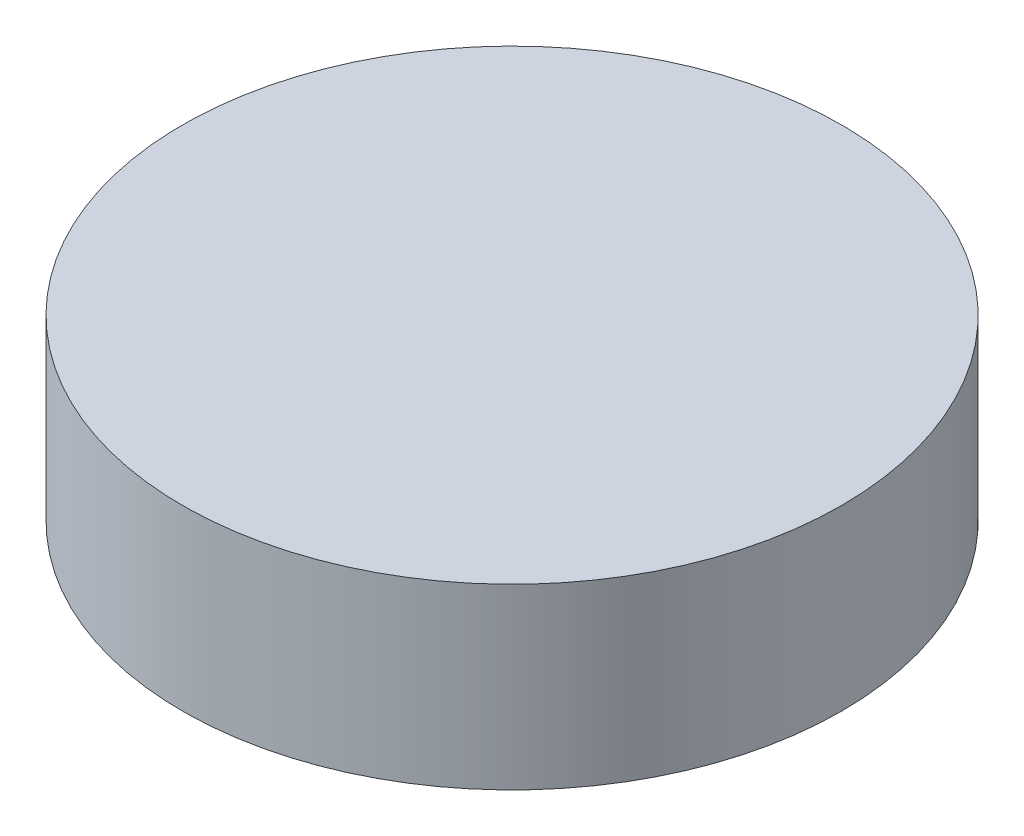
ISO-10303-21;
HEADER;
FILE_DESCRIPTION(('STEP AP214'),'2;1');
FILE_NAME('part.step','',(''),(''),'','','');
FILE_SCHEMA(('AUTOMOTIVE_DESIGN { 1 0 10303 214 1 1 1 1 }'));
ENDSEC;
DATA;
#1=APPLICATION_CONTEXT('core data for automotive mechanical design processes');
#2=APPLICATION_PROTOCOL_DEFINITION('international standard','automotive_design',2000,#1);
#3=PRODUCT_CONTEXT('',#1,'mechanical');
#4=PRODUCT('Part','Part','',(#3));
#5=PRODUCT_RELATED_PRODUCT_CATEGORY('part','',(#4));
#6=PRODUCT_DEFINITION_FORMATION('','',#4);
#7=PRODUCT_DEFINITION_CONTEXT('part definition',#1,'design');
#8=PRODUCT_DEFINITION('design','',#6,#7);
#9=PRODUCT_DEFINITION_SHAPE('','',#8);
#10=(LENGTH_UNIT() NAMED_UNIT(*) SI_UNIT(.MILLI.,.METRE.));
#11=(NAMED_UNIT(*) PLANE_ANGLE_UNIT() SI_UNIT($,.RADIAN.));
#12=(NAMED_UNIT(*) SI_UNIT($,.STERADIAN.) SOLID_ANGLE_UNIT());
#13=UNCERTAINTY_MEASURE_WITH_UNIT(LENGTH_MEASURE(1.E-05),#10,'distance_accuracy_value','');
#14=(GEOMETRIC_REPRESENTATION_CONTEXT(3) GLOBAL_UNCERTAINTY_ASSIGNED_CONTEXT((#13)) GLOBAL_UNIT_ASSIGNED_CONTEXT((#10,
#11,#12)) REPRESENTATION_CONTEXT('',''));
#15=CARTESIAN_POINT('',(0.,0.,0.));
#16=DIRECTION('',(0.,0.,1.));
#17=DIRECTION('',(1.,0.,0.));
#18=AXIS2_PLACEMENT_3D('',#15,#16,#17);
#19=CARTESIAN_POINT('',(0.,16.,0.));
#20=DIRECTION('',(0.,-1.,0.));
#21=DIRECTION('',(1.,0.,0.));
#22=AXIS2_PLACEMENT_3D('',#19,#20,#21);
#23=PLANE('',#22);
#24=CARTESIAN_POINT('',(0.,16.,0.));
#25=DIRECTION('',(0.,-1.,0.));
#26=DIRECTION('',(1.,0.,0.));
#27=AXIS2_PLACEMENT_3D('',#24,#25,#26);
#28=CIRCLE('',#27,22.5);
#29=CARTESIAN_POINT('',(22.5,16.,0.));
#30=VERTEX_POINT('',#29);
#31=EDGE_CURVE('E10',#30,#30,#28,.T.);
#32=ORIENTED_EDGE('',*,*,#31,.T.);
#33=EDGE_LOOP('',(#32));
#34=FACE_BOUND('',#33,.T.);
#35=ADVANCED_FACE('F31',(#34),#23,.T.);
#36=CARTESIAN_POINT('',(0.,0.,0.));
#37=DIRECTION('',(0.,-1.,0.));
#38=DIRECTION('',(1.,0.,0.));
#39=AXIS2_PLACEMENT_3D('',#36,#37,#38);
#40=CYLINDRICAL_SURFACE('',#39,22.5);
#41=CARTESIAN_POINT('',(0.,13.,0.));
#42=DIRECTION('',(0.,-1.,0.));
#43=DIRECTION('',(1.,0.,0.));
#44=AXIS2_PLACEMENT_3D('',#41,#42,#43);
#45=CIRCLE('',#44,22.5);
#46=CARTESIAN_POINT('',(22.5,13.,0.));
#47=VERTEX_POINT('',#46);
#48=EDGE_CURVE('E37',#47,#47,#45,.T.);
#49=ORIENTED_EDGE('',*,*,#48,.T.);
#50=EDGE_LOOP('',(#49));
#51=FACE_BOUND('',#50,.T.);
#52=ORIENTED_EDGE('',*,*,#31,.F.);
#53=EDGE_LOOP('',(#52));
#54=FACE_BOUND('',#53,.T.);
#55=ADVANCED_FACE('F63',(#51,#54),#40,.F.);
#56=CARTESIAN_POINT('',(22.5,13.,0.));
#57=DIRECTION('',(0.,-1.,0.));
#58=DIRECTION('',(1.,0.,0.));
#59=AXIS2_PLACEMENT_3D('',#56,#57,#58);
#60=PLANE('',#59);
#61=CARTESIAN_POINT('',(0.,13.,0.));
#62=DIRECTION('',(0.,-1.,0.));
#63=DIRECTION('',(1.,0.,0.));
#64=AXIS2_PLACEMENT_3D('',#61,#62,#63);
#65=CIRCLE('',#64,37.);
#66=CARTESIAN_POINT('',(37.,13.,0.));
#67=VERTEX_POINT('',#66);
#68=EDGE_CURVE('E41',#67,#67,#65,.T.);
#69=ORIENTED_EDGE('',*,*,#68,.T.);
#70=EDGE_LOOP('',(#69));
#71=FACE_BOUND('',#70,.T.);
#72=ORIENTED_EDGE('',*,*,#48,.F.);
#73=EDGE_LOOP('',(#72));
#74=FACE_BOUND('',#73,.T.);
#75=ADVANCED_FACE('F60',(#71,#74),#60,.T.);
#76=CARTESIAN_POINT('',(0.,0.,0.));
#77=DIRECTION('',(0.,-1.,0.));
#78=DIRECTION('',(1.,0.,0.));
#79=AXIS2_PLACEMENT_3D('',#76,#77,#78);
#80=CYLINDRICAL_SURFACE('',#79,37.);
#81=CARTESIAN_POINT('',(0.,33.,0.));
#82=DIRECTION('',(0.,-1.,0.));
#83=DIRECTION('',(1.,0.,0.));
#84=AXIS2_PLACEMENT_3D('',#81,#82,#83);
#85=CIRCLE('',#84,37.);
#86=CARTESIAN_POINT('',(37.,33.,0.));
#87=VERTEX_POINT('',#86);
#88=EDGE_CURVE('E45',#87,#87,#85,.T.);
#89=ORIENTED_EDGE('',*,*,#88,.T.);
#90=EDGE_LOOP('',(#89));
#91=FACE_BOUND('',#90,.T.);
#92=ORIENTED_EDGE('',*,*,#68,.F.);
#93=EDGE_LOOP('',(#92));
#94=FACE_BOUND('',#93,.T.);
#95=ADVANCED_FACE('F51',(#91,#94),#80,.T.);
#96=CARTESIAN_POINT('',(37.,33.,0.));
#97=DIRECTION('',(0.,1.,0.));
#98=DIRECTION('',(-1.,0.,0.));
#99=AXIS2_PLACEMENT_3D('',#96,#97,#98);
#100=PLANE('',#99);
#101=ORIENTED_EDGE('',*,*,#88,.F.);
#102=EDGE_LOOP('',(#101));
#103=FACE_BOUND('',#102,.T.);
#104=ADVANCED_FACE('F54',(#103),#100,.T.);
#105=CLOSED_SHELL('',(#35,#55,#75,#95,#104));
#106=MANIFOLD_SOLID_BREP('B2',#105);
#107=ADVANCED_BREP_SHAPE_REPRESENTATION('',(#18,#106),#14);
#108=SHAPE_DEFINITION_REPRESENTATION(#9,#107);
ENDSEC;
END-ISO-10303-21;
